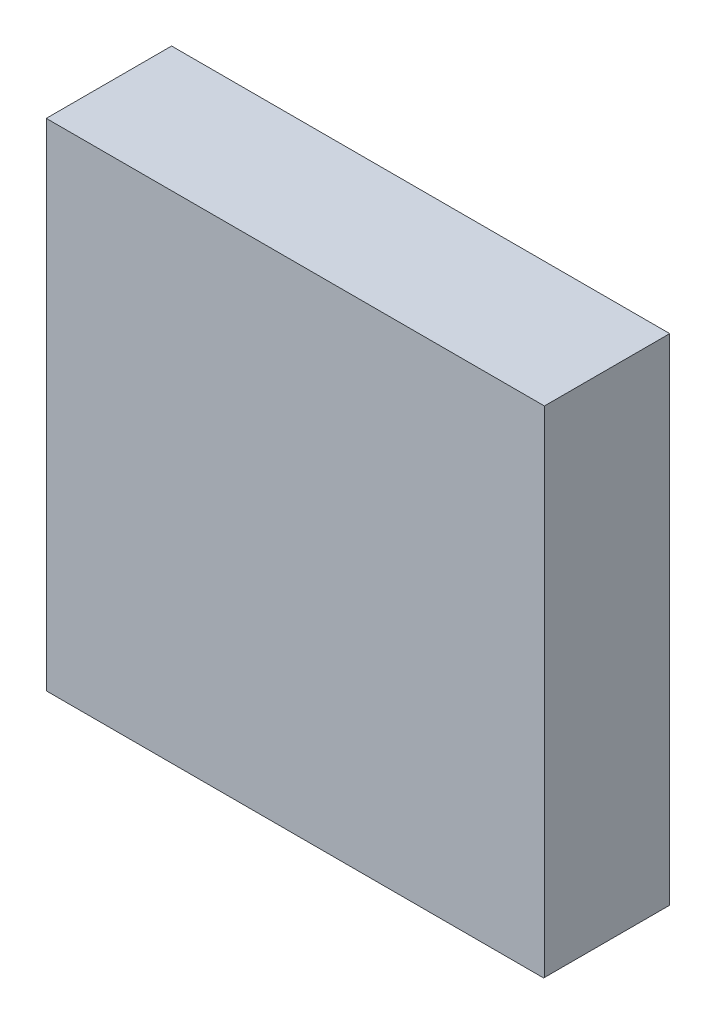
ISO-10303-21;
HEADER;
FILE_DESCRIPTION(('STEP AP214'),'2;1');
FILE_NAME('part.step','',(''),(''),'','','');
FILE_SCHEMA(('AUTOMOTIVE_DESIGN { 1 0 10303 214 1 1 1 1 }'));
ENDSEC;
DATA;
#1=APPLICATION_CONTEXT('core data for automotive mechanical design processes');
#2=APPLICATION_PROTOCOL_DEFINITION('international standard','automotive_design',2000,#1);
#3=PRODUCT_CONTEXT('',#1,'mechanical');
#4=PRODUCT('Part','Part','',(#3));
#5=PRODUCT_RELATED_PRODUCT_CATEGORY('part','',(#4));
#6=PRODUCT_DEFINITION_FORMATION('','',#4);
#7=PRODUCT_DEFINITION_CONTEXT('part definition',#1,'design');
#8=PRODUCT_DEFINITION('design','',#6,#7);
#9=PRODUCT_DEFINITION_SHAPE('','',#8);
#10=(LENGTH_UNIT() NAMED_UNIT(*) SI_UNIT(.MILLI.,.METRE.));
#11=(NAMED_UNIT(*) PLANE_ANGLE_UNIT() SI_UNIT($,.RADIAN.));
#12=(NAMED_UNIT(*) SI_UNIT($,.STERADIAN.) SOLID_ANGLE_UNIT());
#13=UNCERTAINTY_MEASURE_WITH_UNIT(LENGTH_MEASURE(1.E-05),#10,'distance_accuracy_value','');
#14=(GEOMETRIC_REPRESENTATION_CONTEXT(3) GLOBAL_UNCERTAINTY_ASSIGNED_CONTEXT((#13)) GLOBAL_UNIT_ASSIGNED_CONTEXT((#10,
#11,#12)) REPRESENTATION_CONTEXT('',''));
#15=CARTESIAN_POINT('',(0.,0.,0.));
#16=DIRECTION('',(0.,0.,1.));
#17=DIRECTION('',(1.,0.,0.));
#18=AXIS2_PLACEMENT_3D('',#15,#16,#17);
#19=CARTESIAN_POINT('',(1.58999936,1.58250128,0.80000094));
#20=DIRECTION('',(0.,0.,-1.));
#21=DIRECTION('',(0.,-1.,0.));
#22=AXIS2_PLACEMENT_3D('',#19,#20,#21);
#23=PLANE('',#22);
#24=DIRECTION('',(-1.,0.,0.));
#25=VECTOR('',#24,1.);
#26=CARTESIAN_POINT('',(1.58999936,1.58250128,0.80000094));
#27=LINE('',#26,#25);
#28=CARTESIAN_POINT('',(1.58999936,1.58250128,0.80000094));
#29=VERTEX_POINT('',#28);
#30=CARTESIAN_POINT('',(-1.58999682,1.5824962,0.80000094));
#31=VERTEX_POINT('',#30);
#32=EDGE_CURVE('E81',#29,#31,#27,.T.);
#33=ORIENTED_EDGE('',*,*,#32,.T.);
#34=DIRECTION('',(0.,-1.,0.));
#35=VECTOR('',#34,1.);
#36=CARTESIAN_POINT('',(-1.58999682,1.5824962,0.80000094));
#37=LINE('',#36,#35);
#38=CARTESIAN_POINT('',(-1.58999682,-1.58250128,0.80000094));
#39=VERTEX_POINT('',#38);
#40=EDGE_CURVE('E88',#31,#39,#37,.T.);
#41=ORIENTED_EDGE('',*,*,#40,.T.);
#42=DIRECTION('',(1.,0.,0.));
#43=VECTOR('',#42,1.);
#44=CARTESIAN_POINT('',(-1.58999682,-1.58250128,0.80000094));
#45=LINE('',#44,#43);
#46=CARTESIAN_POINT('',(1.5849981,-1.58250128,0.80000094));
#47=VERTEX_POINT('',#46);
#48=EDGE_CURVE('E133',#39,#47,#45,.T.);
#49=ORIENTED_EDGE('',*,*,#48,.T.);
#50=DIRECTION('',(0.707106781194548,0.707106781178548,0.));
#51=VECTOR('',#50,1.);
#52=CARTESIAN_POINT('',(1.5849981,-1.58250128,0.80000094));
#53=LINE('',#52,#51);
#54=CARTESIAN_POINT('',(1.58999936,-1.57750002,0.80000094));
#55=VERTEX_POINT('',#54);
#56=EDGE_CURVE('E137',#47,#55,#53,.T.);
#57=ORIENTED_EDGE('',*,*,#56,.T.);
#58=DIRECTION('',(0.,1.,0.));
#59=VECTOR('',#58,1.);
#60=CARTESIAN_POINT('',(1.58999936,-1.57750002,0.80000094));
#61=LINE('',#60,#59);
#62=EDGE_CURVE('E26',#55,#29,#61,.T.);
#63=ORIENTED_EDGE('',*,*,#62,.T.);
#64=EDGE_LOOP('',(#33,#41,#49,#57,#63));
#65=FACE_BOUND('',#64,.T.);
#66=ADVANCED_FACE('F16',(#65),#23,.F.);
#67=CARTESIAN_POINT('',(1.58999936,1.58250128,0.));
#68=DIRECTION('',(0.,0.,-1.));
#69=DIRECTION('',(0.,-1.,0.));
#70=AXIS2_PLACEMENT_3D('',#67,#68,#69);
#71=PLANE('',#70);
#72=DIRECTION('',(0.,1.,0.));
#73=VECTOR('',#72,1.);
#74=CARTESIAN_POINT('',(1.58999936,-1.57750002,0.));
#75=LINE('',#74,#73);
#76=CARTESIAN_POINT('',(1.58999936,-1.57750002,0.));
#77=VERTEX_POINT('',#76);
#78=CARTESIAN_POINT('',(1.58999936,1.58250128,0.));
#79=VERTEX_POINT('',#78);
#80=EDGE_CURVE('E139',#77,#79,#75,.T.);
#81=ORIENTED_EDGE('',*,*,#80,.F.);
#82=DIRECTION('',(0.707106781194548,0.707106781178548,0.));
#83=VECTOR('',#82,1.);
#84=CARTESIAN_POINT('',(1.5849981,-1.58250128,0.));
#85=LINE('',#84,#83);
#86=CARTESIAN_POINT('',(1.5849981,-1.58250128,0.));
#87=VERTEX_POINT('',#86);
#88=EDGE_CURVE('E129',#87,#77,#85,.T.);
#89=ORIENTED_EDGE('',*,*,#88,.F.);
#90=DIRECTION('',(1.,0.,0.));
#91=VECTOR('',#90,1.);
#92=CARTESIAN_POINT('',(-1.58999682,-1.58250128,0.));
#93=LINE('',#92,#91);
#94=CARTESIAN_POINT('',(-1.58999682,-1.58250128,0.));
#95=VERTEX_POINT('',#94);
#96=EDGE_CURVE('E97',#95,#87,#93,.T.);
#97=ORIENTED_EDGE('',*,*,#96,.F.);
#98=DIRECTION('',(0.,-1.,0.));
#99=VECTOR('',#98,1.);
#100=CARTESIAN_POINT('',(-1.58999682,1.5824962,0.));
#101=LINE('',#100,#99);
#102=CARTESIAN_POINT('',(-1.58999682,1.5824962,0.));
#103=VERTEX_POINT('',#102);
#104=EDGE_CURVE('E107',#103,#95,#101,.T.);
#105=ORIENTED_EDGE('',*,*,#104,.F.);
#106=DIRECTION('',(-1.,0.,0.));
#107=VECTOR('',#106,1.);
#108=CARTESIAN_POINT('',(1.58999936,1.58250128,0.));
#109=LINE('',#108,#107);
#110=EDGE_CURVE('E83',#79,#103,#109,.T.);
#111=ORIENTED_EDGE('',*,*,#110,.F.);
#112=EDGE_LOOP('',(#81,#89,#97,#105,#111));
#113=FACE_BOUND('',#112,.T.);
#114=ADVANCED_FACE('F157',(#113),#71,.T.);
#115=CARTESIAN_POINT('',(1.58999936,-1.57750002,0.));
#116=DIRECTION('',(-1.,0.,0.));
#117=DIRECTION('',(0.,0.,1.));
#118=AXIS2_PLACEMENT_3D('',#115,#116,#117);
#119=PLANE('',#118);
#120=ORIENTED_EDGE('',*,*,#80,.T.);
#121=DIRECTION('',(0.,0.,1.));
#122=VECTOR('',#121,1.);
#123=CARTESIAN_POINT('',(1.58999936,1.58250128,0.));
#124=LINE('',#123,#122);
#125=EDGE_CURVE('E91',#79,#29,#124,.T.);
#126=ORIENTED_EDGE('',*,*,#125,.T.);
#127=ORIENTED_EDGE('',*,*,#62,.F.);
#128=DIRECTION('',(0.,0.,1.));
#129=VECTOR('',#128,1.);
#130=CARTESIAN_POINT('',(1.58999936,-1.57750002,0.));
#131=LINE('',#130,#129);
#132=EDGE_CURVE('E132',#77,#55,#131,.T.);
#133=ORIENTED_EDGE('',*,*,#132,.F.);
#134=EDGE_LOOP('',(#120,#126,#127,#133));
#135=FACE_BOUND('',#134,.T.);
#136=ADVANCED_FACE('F155',(#135),#119,.F.);
#137=CARTESIAN_POINT('',(1.5849981,-1.58250128,0.));
#138=DIRECTION('',(-0.707106781178548,0.707106781194548,0.));
#139=DIRECTION('',(0.,0.,1.));
#140=AXIS2_PLACEMENT_3D('',#137,#138,#139);
#141=PLANE('',#140);
#142=ORIENTED_EDGE('',*,*,#88,.T.);
#143=ORIENTED_EDGE('',*,*,#132,.T.);
#144=ORIENTED_EDGE('',*,*,#56,.F.);
#145=DIRECTION('',(0.,0.,1.));
#146=VECTOR('',#145,1.);
#147=CARTESIAN_POINT('',(1.5849981,-1.58250128,0.));
#148=LINE('',#147,#146);
#149=EDGE_CURVE('E104',#87,#47,#148,.T.);
#150=ORIENTED_EDGE('',*,*,#149,.F.);
#151=EDGE_LOOP('',(#142,#143,#144,#150));
#152=FACE_BOUND('',#151,.T.);
#153=ADVANCED_FACE('F154',(#152),#141,.F.);
#154=CARTESIAN_POINT('',(-1.58999682,-1.58250128,0.));
#155=DIRECTION('',(0.,1.,0.));
#156=DIRECTION('',(1.,0.,0.));
#157=AXIS2_PLACEMENT_3D('',#154,#155,#156);
#158=PLANE('',#157);
#159=ORIENTED_EDGE('',*,*,#96,.T.);
#160=ORIENTED_EDGE('',*,*,#149,.T.);
#161=ORIENTED_EDGE('',*,*,#48,.F.);
#162=DIRECTION('',(0.,0.,1.));
#163=VECTOR('',#162,1.);
#164=CARTESIAN_POINT('',(-1.58999682,-1.58250128,0.));
#165=LINE('',#164,#163);
#166=EDGE_CURVE('E95',#95,#39,#165,.T.);
#167=ORIENTED_EDGE('',*,*,#166,.F.);
#168=EDGE_LOOP('',(#159,#160,#161,#167));
#169=FACE_BOUND('',#168,.T.);
#170=ADVANCED_FACE('F152',(#169),#158,.F.);
#171=CARTESIAN_POINT('',(-1.58999682,1.5824962,0.));
#172=DIRECTION('',(1.,0.,0.));
#173=DIRECTION('',(0.,1.,0.));
#174=AXIS2_PLACEMENT_3D('',#171,#172,#173);
#175=PLANE('',#174);
#176=DIRECTION('',(0.,0.,-1.));
#177=VECTOR('',#176,1.);
#178=CARTESIAN_POINT('',(-1.58999682,1.58250128,0.));
#179=LINE('',#178,#177);
#180=EDGE_CURVE('E11',#103,#31,#179,.F.);
#181=ORIENTED_EDGE('',*,*,#180,.F.);
#182=ORIENTED_EDGE('',*,*,#104,.T.);
#183=ORIENTED_EDGE('',*,*,#166,.T.);
#184=ORIENTED_EDGE('',*,*,#40,.F.);
#185=EDGE_LOOP('',(#181,#182,#183,#184));
#186=FACE_BOUND('',#185,.T.);
#187=ADVANCED_FACE('F93',(#186),#175,.F.);
#188=CARTESIAN_POINT('',(1.58999936,1.58250128,0.));
#189=DIRECTION('',(0.,-1.,0.));
#190=DIRECTION('',(0.,0.,-1.));
#191=AXIS2_PLACEMENT_3D('',#188,#189,#190);
#192=PLANE('',#191);
#193=ORIENTED_EDGE('',*,*,#110,.T.);
#194=ORIENTED_EDGE('',*,*,#180,.T.);
#195=ORIENTED_EDGE('',*,*,#32,.F.);
#196=ORIENTED_EDGE('',*,*,#125,.F.);
#197=EDGE_LOOP('',(#193,#194,#195,#196));
#198=FACE_BOUND('',#197,.T.);
#199=ADVANCED_FACE('F18',(#198),#192,.F.);
#200=CLOSED_SHELL('',(#66,#114,#136,#153,#170,#187,#199));
#201=MANIFOLD_SOLID_BREP('B1',#200);
#202=ADVANCED_BREP_SHAPE_REPRESENTATION('',(#18,#201),#14);
#203=SHAPE_DEFINITION_REPRESENTATION(#9,#202);
ENDSEC;
END-ISO-10303-21;
